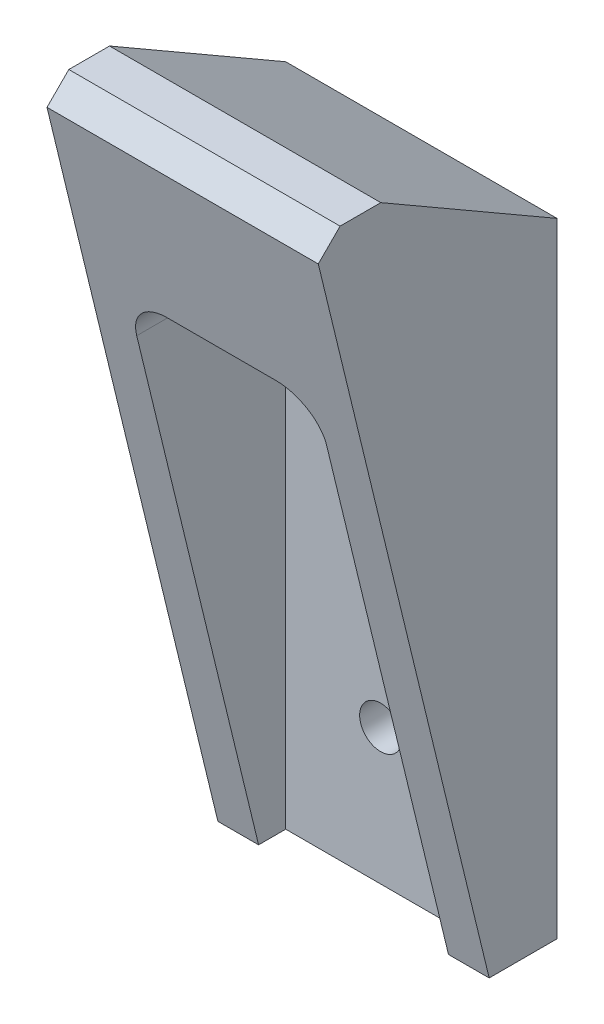
ISO-10303-21;
HEADER;
FILE_DESCRIPTION(('STEP AP214'),'2;1');
FILE_NAME('part.step','',(''),(''),'','','');
FILE_SCHEMA(('AUTOMOTIVE_DESIGN { 1 0 10303 214 1 1 1 1 }'));
ENDSEC;
DATA;
#1=APPLICATION_CONTEXT('core data for automotive mechanical design processes');
#2=APPLICATION_PROTOCOL_DEFINITION('international standard','automotive_design',2000,#1);
#3=PRODUCT_CONTEXT('',#1,'mechanical');
#4=PRODUCT('Part','Part','',(#3));
#5=PRODUCT_RELATED_PRODUCT_CATEGORY('part','',(#4));
#6=PRODUCT_DEFINITION_FORMATION('','',#4);
#7=PRODUCT_DEFINITION_CONTEXT('part definition',#1,'design');
#8=PRODUCT_DEFINITION('design','',#6,#7);
#9=PRODUCT_DEFINITION_SHAPE('','',#8);
#10=(LENGTH_UNIT() NAMED_UNIT(*) SI_UNIT(.MILLI.,.METRE.));
#11=(NAMED_UNIT(*) PLANE_ANGLE_UNIT() SI_UNIT($,.RADIAN.));
#12=(NAMED_UNIT(*) SI_UNIT($,.STERADIAN.) SOLID_ANGLE_UNIT());
#13=UNCERTAINTY_MEASURE_WITH_UNIT(LENGTH_MEASURE(1.E-05),#10,'distance_accuracy_value','');
#14=(GEOMETRIC_REPRESENTATION_CONTEXT(3) GLOBAL_UNCERTAINTY_ASSIGNED_CONTEXT((#13)) GLOBAL_UNIT_ASSIGNED_CONTEXT((#10,
#11,#12)) REPRESENTATION_CONTEXT('',''));
#15=CARTESIAN_POINT('',(0.,0.,0.));
#16=DIRECTION('',(0.,0.,1.));
#17=DIRECTION('',(1.,0.,0.));
#18=AXIS2_PLACEMENT_3D('',#15,#16,#17);
#19=CARTESIAN_POINT('',(20.,53.5,17.9903810567666));
#20=DIRECTION('',(0.,0.235954857589734,-0.971764017228364));
#21=DIRECTION('',(0.,0.971764017228364,0.235954857589734));
#22=AXIS2_PLACEMENT_3D('',#19,#20,#21);
#23=PLANE('',#22);
#24=DIRECTION('',(0.,-0.971764017228364,-0.235954857589734));
#25=VECTOR('',#24,1.);
#26=CARTESIAN_POINT('',(20.,53.5,17.9903810567666));
#27=LINE('',#26,#25);
#28=CARTESIAN_POINT('',(20.,51.8907446716443,17.5996363851223));
#29=VERTEX_POINT('',#28);
#30=CARTESIAN_POINT('',(20.,0.,5.));
#31=VERTEX_POINT('',#30);
#32=EDGE_CURVE('E170',#29,#31,#27,.T.);
#33=ORIENTED_EDGE('',*,*,#32,.F.);
#34=DIRECTION('',(-1.,0.,0.));
#35=VECTOR('',#34,1.);
#36=CARTESIAN_POINT('',(20.,51.8907446716443,17.5996363851223));
#37=LINE('',#36,#35);
#38=CARTESIAN_POINT('',(0.,51.8907446716443,17.5996363851223));
#39=VERTEX_POINT('',#38);
#40=EDGE_CURVE('E214',#29,#39,#37,.T.);
#41=ORIENTED_EDGE('',*,*,#40,.T.);
#42=DIRECTION('',(0.,-0.971764017228364,-0.235954857589734));
#43=VECTOR('',#42,1.);
#44=CARTESIAN_POINT('',(0.,53.5,17.9903810567666));
#45=LINE('',#44,#43);
#46=CARTESIAN_POINT('',(0.,0.,5.));
#47=VERTEX_POINT('',#46);
#48=EDGE_CURVE('E181',#39,#47,#45,.T.);
#49=ORIENTED_EDGE('',*,*,#48,.T.);
#50=DIRECTION('',(-1.,0.,0.));
#51=VECTOR('',#50,1.);
#52=CARTESIAN_POINT('',(20.,0.,5.));
#53=LINE('',#52,#51);
#54=CARTESIAN_POINT('',(3.,0.,5.));
#55=VERTEX_POINT('',#54);
#56=EDGE_CURVE('E186',#55,#47,#53,.T.);
#57=ORIENTED_EDGE('',*,*,#56,.F.);
#58=DIRECTION('',(0.,-0.971764017228364,-0.235954857589734));
#59=VECTOR('',#58,1.);
#60=CARTESIAN_POINT('',(3.,53.5,17.9903810567666));
#61=LINE('',#60,#59);
#62=CARTESIAN_POINT('',(3.,37.,13.9840018523433));
#63=VERTEX_POINT('',#62);
#64=EDGE_CURVE('E159',#63,#55,#61,.T.);
#65=ORIENTED_EDGE('',*,*,#64,.F.);
#66=CARTESIAN_POINT('',(6.,37.,13.9840018523433));
#67=DIRECTION('',(0.,0.235954857589734,-0.971764017228364));
#68=DIRECTION('',(0.,-0.971764017228364,-0.235954857589734));
#69=AXIS2_PLACEMENT_3D('',#66,#67,#68);
#70=ELLIPSE('',#69,3.08716925798149,3.);
#71=CARTESIAN_POINT('',(6.,40.,14.7124344349657));
#72=VERTEX_POINT('',#71);
#73=EDGE_CURVE('E210',#63,#72,#70,.T.);
#74=ORIENTED_EDGE('',*,*,#73,.T.);
#75=DIRECTION('',(-1.,0.,0.));
#76=VECTOR('',#75,1.);
#77=CARTESIAN_POINT('',(20.,40.,14.7124344349657));
#78=LINE('',#77,#76);
#79=CARTESIAN_POINT('',(14.,40.,14.7124344349657));
#80=VERTEX_POINT('',#79);
#81=EDGE_CURVE('E194',#80,#72,#78,.T.);
#82=ORIENTED_EDGE('',*,*,#81,.F.);
#83=CARTESIAN_POINT('',(14.,37.,13.9840018523433));
#84=DIRECTION('',(0.,0.235954857589734,-0.971764017228364));
#85=DIRECTION('',(0.,-0.971764017228364,-0.235954857589734));
#86=AXIS2_PLACEMENT_3D('',#83,#84,#85);
#87=ELLIPSE('',#86,3.08716925798149,3.);
#88=CARTESIAN_POINT('',(17.,37.,13.9840018523433));
#89=VERTEX_POINT('',#88);
#90=EDGE_CURVE('E212',#80,#89,#87,.T.);
#91=ORIENTED_EDGE('',*,*,#90,.T.);
#92=DIRECTION('',(0.,0.971764017228364,0.235954857589734));
#93=VECTOR('',#92,1.);
#94=CARTESIAN_POINT('',(17.,53.5,17.9903810567666));
#95=LINE('',#94,#93);
#96=CARTESIAN_POINT('',(17.,0.,5.));
#97=VERTEX_POINT('',#96);
#98=EDGE_CURVE('E157',#97,#89,#95,.T.);
#99=ORIENTED_EDGE('',*,*,#98,.F.);
#100=EDGE_CURVE('E149',#31,#97,#53,.T.);
#101=ORIENTED_EDGE('',*,*,#100,.F.);
#102=EDGE_LOOP('',(#33,#41,#49,#57,#65,#74,#82,#91,#99,#101));
#103=FACE_BOUND('',#102,.T.);
#104=ADVANCED_FACE('F34',(#103),#23,.F.);
#105=CARTESIAN_POINT('',(20.,0.,0.));
#106=DIRECTION('',(0.,1.,0.));
#107=DIRECTION('',(0.,0.,1.));
#108=AXIS2_PLACEMENT_3D('',#105,#106,#107);
#109=PLANE('',#108);
#110=DIRECTION('',(0.,0.,1.));
#111=VECTOR('',#110,1.);
#112=CARTESIAN_POINT('',(3.,0.,-42.3792402008342));
#113=LINE('',#112,#111);
#114=CARTESIAN_POINT('',(3.,0.,3.));
#115=VERTEX_POINT('',#114);
#116=EDGE_CURVE('E150',#115,#55,#113,.T.);
#117=ORIENTED_EDGE('',*,*,#116,.T.);
#118=ORIENTED_EDGE('',*,*,#56,.T.);
#119=DIRECTION('',(0.,0.,-1.));
#120=VECTOR('',#119,1.);
#121=CARTESIAN_POINT('',(0.,0.,0.));
#122=LINE('',#121,#120);
#123=CARTESIAN_POINT('',(0.,0.,0.));
#124=VERTEX_POINT('',#123);
#125=EDGE_CURVE('E166',#47,#124,#122,.T.);
#126=ORIENTED_EDGE('',*,*,#125,.T.);
#127=DIRECTION('',(-1.,0.,0.));
#128=VECTOR('',#127,1.);
#129=CARTESIAN_POINT('',(20.,0.,0.));
#130=LINE('',#129,#128);
#131=CARTESIAN_POINT('',(20.,0.,0.));
#132=VERTEX_POINT('',#131);
#133=EDGE_CURVE('E174',#132,#124,#130,.T.);
#134=ORIENTED_EDGE('',*,*,#133,.F.);
#135=DIRECTION('',(0.,0.,-1.));
#136=VECTOR('',#135,1.);
#137=CARTESIAN_POINT('',(20.,0.,0.));
#138=LINE('',#137,#136);
#139=EDGE_CURVE('E172',#31,#132,#138,.T.);
#140=ORIENTED_EDGE('',*,*,#139,.F.);
#141=ORIENTED_EDGE('',*,*,#100,.T.);
#142=DIRECTION('',(0.,0.,1.));
#143=VECTOR('',#142,1.);
#144=CARTESIAN_POINT('',(17.,0.,-42.3792402008342));
#145=LINE('',#144,#143);
#146=CARTESIAN_POINT('',(17.,0.,3.));
#147=VERTEX_POINT('',#146);
#148=EDGE_CURVE('E127',#147,#97,#145,.T.);
#149=ORIENTED_EDGE('',*,*,#148,.F.);
#150=DIRECTION('',(-1.,0.,0.));
#151=VECTOR('',#150,1.);
#152=CARTESIAN_POINT('',(0.,0.,3.));
#153=LINE('',#152,#151);
#154=EDGE_CURVE('E134',#147,#115,#153,.T.);
#155=ORIENTED_EDGE('',*,*,#154,.T.);
#156=EDGE_LOOP('',(#117,#118,#126,#134,#140,#141,#149,#155));
#157=FACE_BOUND('',#156,.T.);
#158=ADVANCED_FACE('F146',(#157),#109,.F.);
#159=CARTESIAN_POINT('',(20.,0.,0.));
#160=DIRECTION('',(0.,0.,1.));
#161=DIRECTION('',(1.,0.,0.));
#162=AXIS2_PLACEMENT_3D('',#159,#160,#161);
#163=PLANE('',#162);
#164=CARTESIAN_POINT('',(10.,30.,0.));
#165=DIRECTION('',(0.,0.,1.));
#166=DIRECTION('',(1.,0.,0.));
#167=AXIS2_PLACEMENT_3D('',#164,#165,#166);
#168=CIRCLE('',#167,1.549999948);
#169=CARTESIAN_POINT('',(11.549999948,30.,0.));
#170=VERTEX_POINT('',#169);
#171=EDGE_CURVE('E307',#170,#170,#168,.T.);
#172=ORIENTED_EDGE('',*,*,#171,.T.);
#173=EDGE_LOOP('',(#172));
#174=FACE_BOUND('',#173,.T.);
#175=CARTESIAN_POINT('',(10.,10.,0.));
#176=DIRECTION('',(0.,0.,1.));
#177=DIRECTION('',(1.,0.,0.));
#178=AXIS2_PLACEMENT_3D('',#175,#176,#177);
#179=CIRCLE('',#178,1.549999948);
#180=CARTESIAN_POINT('',(11.549999948,10.,0.));
#181=VERTEX_POINT('',#180);
#182=EDGE_CURVE('E153',#181,#181,#179,.T.);
#183=ORIENTED_EDGE('',*,*,#182,.T.);
#184=EDGE_LOOP('',(#183));
#185=FACE_BOUND('',#184,.T.);
#186=DIRECTION('',(0.,1.,0.));
#187=VECTOR('',#186,1.);
#188=CARTESIAN_POINT('',(0.,0.,0.));
#189=LINE('',#188,#187);
#190=CARTESIAN_POINT('',(0.,46.,0.));
#191=VERTEX_POINT('',#190);
#192=EDGE_CURVE('E161',#124,#191,#189,.T.);
#193=ORIENTED_EDGE('',*,*,#192,.T.);
#194=DIRECTION('',(-1.,0.,0.));
#195=VECTOR('',#194,1.);
#196=CARTESIAN_POINT('',(20.,46.,0.));
#197=LINE('',#196,#195);
#198=CARTESIAN_POINT('',(20.,46.,0.));
#199=VERTEX_POINT('',#198);
#200=EDGE_CURVE('E191',#199,#191,#197,.T.);
#201=ORIENTED_EDGE('',*,*,#200,.F.);
#202=DIRECTION('',(0.,1.,0.));
#203=VECTOR('',#202,1.);
#204=CARTESIAN_POINT('',(20.,0.,0.));
#205=LINE('',#204,#203);
#206=EDGE_CURVE('E162',#132,#199,#205,.T.);
#207=ORIENTED_EDGE('',*,*,#206,.F.);
#208=ORIENTED_EDGE('',*,*,#133,.T.);
#209=EDGE_LOOP('',(#193,#201,#207,#208));
#210=FACE_BOUND('',#209,.T.);
#211=ADVANCED_FACE('F230',(#174,#185,#210),#163,.F.);
#212=CARTESIAN_POINT('',(20.,46.,0.));
#213=DIRECTION('',(0.,-0.86602540378444,0.499999999999997));
#214=DIRECTION('',(0.,-0.499999999999997,-0.86602540378444));
#215=AXIS2_PLACEMENT_3D('',#212,#213,#214);
#216=PLANE('',#215);
#217=DIRECTION('',(0.,0.499999999999997,0.86602540378444));
#218=VECTOR('',#217,1.);
#219=CARTESIAN_POINT('',(0.,46.,0.));
#220=LINE('',#219,#218);
#221=CARTESIAN_POINT('',(0.,53.5,12.9903810567666));
#222=VERTEX_POINT('',#221);
#223=EDGE_CURVE('E177',#191,#222,#220,.T.);
#224=ORIENTED_EDGE('',*,*,#223,.T.);
#225=DIRECTION('',(-1.,0.,0.));
#226=VECTOR('',#225,1.);
#227=CARTESIAN_POINT('',(20.,53.5,12.9903810567666));
#228=LINE('',#227,#226);
#229=CARTESIAN_POINT('',(20.,53.5,12.9903810567666));
#230=VERTEX_POINT('',#229);
#231=EDGE_CURVE('E188',#230,#222,#228,.T.);
#232=ORIENTED_EDGE('',*,*,#231,.F.);
#233=DIRECTION('',(0.,0.499999999999997,0.86602540378444));
#234=VECTOR('',#233,1.);
#235=CARTESIAN_POINT('',(20.,46.,0.));
#236=LINE('',#235,#234);
#237=EDGE_CURVE('E165',#199,#230,#236,.T.);
#238=ORIENTED_EDGE('',*,*,#237,.F.);
#239=ORIENTED_EDGE('',*,*,#200,.T.);
#240=EDGE_LOOP('',(#224,#232,#238,#239));
#241=FACE_BOUND('',#240,.T.);
#242=ADVANCED_FACE('F269',(#241),#216,.F.);
#243=CARTESIAN_POINT('',(20.,53.5,12.9903810567666));
#244=DIRECTION('',(0.,-1.,0.));
#245=DIRECTION('',(0.,0.,-1.));
#246=AXIS2_PLACEMENT_3D('',#243,#244,#245);
#247=PLANE('',#246);
#248=DIRECTION('',(0.,0.,1.));
#249=VECTOR('',#248,1.);
#250=CARTESIAN_POINT('',(0.,53.5,12.9903810567666));
#251=LINE('',#250,#249);
#252=CARTESIAN_POINT('',(0.,53.5,15.9903810567666));
#253=VERTEX_POINT('',#252);
#254=EDGE_CURVE('E179',#222,#253,#251,.T.);
#255=ORIENTED_EDGE('',*,*,#254,.T.);
#256=DIRECTION('',(1.,0.,0.));
#257=VECTOR('',#256,1.);
#258=CARTESIAN_POINT('',(20.,53.5,15.9903810567666));
#259=LINE('',#258,#257);
#260=CARTESIAN_POINT('',(20.,53.5,15.9903810567666));
#261=VERTEX_POINT('',#260);
#262=EDGE_CURVE('E42',#253,#261,#259,.T.);
#263=ORIENTED_EDGE('',*,*,#262,.T.);
#264=DIRECTION('',(0.,0.,1.));
#265=VECTOR('',#264,1.);
#266=CARTESIAN_POINT('',(20.,53.5,12.9903810567666));
#267=LINE('',#266,#265);
#268=EDGE_CURVE('E168',#230,#261,#267,.T.);
#269=ORIENTED_EDGE('',*,*,#268,.F.);
#270=ORIENTED_EDGE('',*,*,#231,.T.);
#271=EDGE_LOOP('',(#255,#263,#269,#270));
#272=FACE_BOUND('',#271,.T.);
#273=ADVANCED_FACE('F266',(#272),#247,.F.);
#274=CARTESIAN_POINT('',(20.,0.,0.));
#275=DIRECTION('',(1.,0.,0.));
#276=DIRECTION('',(0.,0.,-1.));
#277=AXIS2_PLACEMENT_3D('',#274,#275,#276);
#278=PLANE('',#277);
#279=ORIENTED_EDGE('',*,*,#268,.T.);
#280=DIRECTION('',(0.,0.707106781186546,-0.707106781186549));
#281=VECTOR('',#280,1.);
#282=CARTESIAN_POINT('',(20.,34.7451905283834,34.7451905283832));
#283=LINE('',#282,#281);
#284=EDGE_CURVE('E12',#261,#29,#283,.F.);
#285=ORIENTED_EDGE('',*,*,#284,.T.);
#286=ORIENTED_EDGE('',*,*,#32,.T.);
#287=ORIENTED_EDGE('',*,*,#139,.T.);
#288=ORIENTED_EDGE('',*,*,#206,.T.);
#289=ORIENTED_EDGE('',*,*,#237,.T.);
#290=EDGE_LOOP('',(#279,#285,#286,#287,#288,#289));
#291=FACE_BOUND('',#290,.T.);
#292=ADVANCED_FACE('F233',(#291),#278,.T.);
#293=CARTESIAN_POINT('',(0.,0.,0.));
#294=DIRECTION('',(1.,0.,0.));
#295=DIRECTION('',(0.,0.,-1.));
#296=AXIS2_PLACEMENT_3D('',#293,#294,#295);
#297=PLANE('',#296);
#298=ORIENTED_EDGE('',*,*,#48,.F.);
#299=DIRECTION('',(0.,-0.707106781186546,0.707106781186549));
#300=VECTOR('',#299,1.);
#301=CARTESIAN_POINT('',(0.,51.8907446716443,17.5996363851223));
#302=LINE('',#301,#300);
#303=EDGE_CURVE('E56',#39,#253,#302,.F.);
#304=ORIENTED_EDGE('',*,*,#303,.T.);
#305=ORIENTED_EDGE('',*,*,#254,.F.);
#306=ORIENTED_EDGE('',*,*,#223,.F.);
#307=ORIENTED_EDGE('',*,*,#192,.F.);
#308=ORIENTED_EDGE('',*,*,#125,.F.);
#309=EDGE_LOOP('',(#298,#304,#305,#306,#307,#308));
#310=FACE_BOUND('',#309,.T.);
#311=ADVANCED_FACE('F225',(#310),#297,.F.);
#312=CARTESIAN_POINT('',(0.,40.,-42.3792402008342));
#313=DIRECTION('',(0.,-1.,0.));
#314=DIRECTION('',(0.,0.,-1.));
#315=AXIS2_PLACEMENT_3D('',#312,#313,#314);
#316=PLANE('',#315);
#317=ORIENTED_EDGE('',*,*,#81,.T.);
#318=DIRECTION('',(0.,0.,1.));
#319=VECTOR('',#318,1.);
#320=CARTESIAN_POINT('',(6.,40.,3.));
#321=LINE('',#320,#319);
#322=CARTESIAN_POINT('',(6.,40.,3.));
#323=VERTEX_POINT('',#322);
#324=EDGE_CURVE('E203',#72,#323,#321,.F.);
#325=ORIENTED_EDGE('',*,*,#324,.T.);
#326=DIRECTION('',(-1.,0.,0.));
#327=VECTOR('',#326,1.);
#328=CARTESIAN_POINT('',(0.,40.,3.));
#329=LINE('',#328,#327);
#330=CARTESIAN_POINT('',(14.,40.,3.));
#331=VERTEX_POINT('',#330);
#332=EDGE_CURVE('E133',#331,#323,#329,.T.);
#333=ORIENTED_EDGE('',*,*,#332,.F.);
#334=DIRECTION('',(0.,0.,1.));
#335=VECTOR('',#334,1.);
#336=CARTESIAN_POINT('',(14.,40.,14.7124344349657));
#337=LINE('',#336,#335);
#338=EDGE_CURVE('E200',#331,#80,#337,.T.);
#339=ORIENTED_EDGE('',*,*,#338,.T.);
#340=EDGE_LOOP('',(#317,#325,#333,#339));
#341=FACE_BOUND('',#340,.T.);
#342=ADVANCED_FACE('F242',(#341),#316,.T.);
#343=CARTESIAN_POINT('',(3.,0.,-42.3792402008342));
#344=DIRECTION('',(1.,0.,0.));
#345=DIRECTION('',(0.,0.,-1.));
#346=AXIS2_PLACEMENT_3D('',#343,#344,#345);
#347=PLANE('',#346);
#348=DIRECTION('',(0.,-1.,0.));
#349=VECTOR('',#348,1.);
#350=CARTESIAN_POINT('',(3.,0.,3.));
#351=LINE('',#350,#349);
#352=CARTESIAN_POINT('',(3.,37.,3.));
#353=VERTEX_POINT('',#352);
#354=EDGE_CURVE('E140',#353,#115,#351,.T.);
#355=ORIENTED_EDGE('',*,*,#354,.F.);
#356=DIRECTION('',(0.,0.,1.));
#357=VECTOR('',#356,1.);
#358=CARTESIAN_POINT('',(3.,37.,14.7124344349657));
#359=LINE('',#358,#357);
#360=EDGE_CURVE('E197',#353,#63,#359,.T.);
#361=ORIENTED_EDGE('',*,*,#360,.T.);
#362=ORIENTED_EDGE('',*,*,#64,.T.);
#363=ORIENTED_EDGE('',*,*,#116,.F.);
#364=EDGE_LOOP('',(#355,#361,#362,#363));
#365=FACE_BOUND('',#364,.T.);
#366=ADVANCED_FACE('F248',(#365),#347,.T.);
#367=CARTESIAN_POINT('',(17.,0.,-42.3792402008342));
#368=DIRECTION('',(-1.,0.,0.));
#369=DIRECTION('',(0.,0.,1.));
#370=AXIS2_PLACEMENT_3D('',#367,#368,#369);
#371=PLANE('',#370);
#372=ORIENTED_EDGE('',*,*,#98,.T.);
#373=DIRECTION('',(0.,0.,1.));
#374=VECTOR('',#373,1.);
#375=CARTESIAN_POINT('',(17.,37.,3.));
#376=LINE('',#375,#374);
#377=CARTESIAN_POINT('',(17.,37.,3.));
#378=VERTEX_POINT('',#377);
#379=EDGE_CURVE('E130',#89,#378,#376,.F.);
#380=ORIENTED_EDGE('',*,*,#379,.T.);
#381=DIRECTION('',(0.,1.,0.));
#382=VECTOR('',#381,1.);
#383=CARTESIAN_POINT('',(17.,0.,3.));
#384=LINE('',#383,#382);
#385=EDGE_CURVE('E122',#147,#378,#384,.T.);
#386=ORIENTED_EDGE('',*,*,#385,.F.);
#387=ORIENTED_EDGE('',*,*,#148,.T.);
#388=EDGE_LOOP('',(#372,#380,#386,#387));
#389=FACE_BOUND('',#388,.T.);
#390=ADVANCED_FACE('F125',(#389),#371,.T.);
#391=CARTESIAN_POINT('',(20.,0.,3.));
#392=DIRECTION('',(0.,0.,1.));
#393=DIRECTION('',(1.,0.,0.));
#394=AXIS2_PLACEMENT_3D('',#391,#392,#393);
#395=PLANE('',#394);
#396=CARTESIAN_POINT('',(10.,30.,3.));
#397=DIRECTION('',(0.,0.,1.));
#398=DIRECTION('',(1.,0.,0.));
#399=AXIS2_PLACEMENT_3D('',#396,#397,#398);
#400=CIRCLE('',#399,1.54999994799999);
#401=CARTESIAN_POINT('',(11.549999948,30.,3.));
#402=VERTEX_POINT('',#401);
#403=EDGE_CURVE('E303',#402,#402,#400,.T.);
#404=ORIENTED_EDGE('',*,*,#403,.F.);
#405=EDGE_LOOP('',(#404));
#406=FACE_BOUND('',#405,.T.);
#407=CARTESIAN_POINT('',(10.,10.,3.));
#408=DIRECTION('',(0.,0.,1.));
#409=DIRECTION('',(1.,0.,0.));
#410=AXIS2_PLACEMENT_3D('',#407,#408,#409);
#411=CIRCLE('',#410,1.54999994799999);
#412=CARTESIAN_POINT('',(11.549999948,10.,3.));
#413=VERTEX_POINT('',#412);
#414=EDGE_CURVE('E306',#413,#413,#411,.T.);
#415=ORIENTED_EDGE('',*,*,#414,.F.);
#416=EDGE_LOOP('',(#415));
#417=FACE_BOUND('',#416,.T.);
#418=ORIENTED_EDGE('',*,*,#332,.T.);
#419=CARTESIAN_POINT('',(6.,37.,3.));
#420=DIRECTION('',(0.,0.,1.));
#421=DIRECTION('',(1.,0.,0.));
#422=AXIS2_PLACEMENT_3D('',#419,#420,#421);
#423=CIRCLE('',#422,3.);
#424=EDGE_CURVE('E207',#323,#353,#423,.T.);
#425=ORIENTED_EDGE('',*,*,#424,.T.);
#426=ORIENTED_EDGE('',*,*,#354,.T.);
#427=ORIENTED_EDGE('',*,*,#154,.F.);
#428=ORIENTED_EDGE('',*,*,#385,.T.);
#429=CARTESIAN_POINT('',(14.,37.,3.));
#430=DIRECTION('',(0.,0.,1.));
#431=DIRECTION('',(1.,0.,0.));
#432=AXIS2_PLACEMENT_3D('',#429,#430,#431);
#433=CIRCLE('',#432,3.);
#434=EDGE_CURVE('E205',#378,#331,#433,.T.);
#435=ORIENTED_EDGE('',*,*,#434,.T.);
#436=EDGE_LOOP('',(#418,#425,#426,#427,#428,#435));
#437=FACE_BOUND('',#436,.T.);
#438=ADVANCED_FACE('F138',(#406,#417,#437),#395,.T.);
#439=CARTESIAN_POINT('',(6.,37.,-42.3792402008342));
#440=DIRECTION('',(0.,0.,-1.));
#441=DIRECTION('',(-1.,0.,0.));
#442=AXIS2_PLACEMENT_3D('',#439,#440,#441);
#443=CYLINDRICAL_SURFACE('',#442,3.);
#444=ORIENTED_EDGE('',*,*,#424,.F.);
#445=ORIENTED_EDGE('',*,*,#324,.F.);
#446=ORIENTED_EDGE('',*,*,#73,.F.);
#447=ORIENTED_EDGE('',*,*,#360,.F.);
#448=EDGE_LOOP('',(#444,#445,#446,#447));
#449=FACE_BOUND('',#448,.T.);
#450=ADVANCED_FACE('F245',(#449),#443,.F.);
#451=CARTESIAN_POINT('',(14.,37.,-42.3792402008342));
#452=DIRECTION('',(0.,0.,-1.));
#453=DIRECTION('',(-1.,0.,0.));
#454=AXIS2_PLACEMENT_3D('',#451,#452,#453);
#455=CYLINDRICAL_SURFACE('',#454,3.);
#456=ORIENTED_EDGE('',*,*,#434,.F.);
#457=ORIENTED_EDGE('',*,*,#379,.F.);
#458=ORIENTED_EDGE('',*,*,#90,.F.);
#459=ORIENTED_EDGE('',*,*,#338,.F.);
#460=EDGE_LOOP('',(#456,#457,#458,#459));
#461=FACE_BOUND('',#460,.T.);
#462=ADVANCED_FACE('F237',(#461),#455,.F.);
#463=CARTESIAN_POINT('',(20.,51.8907446716443,17.5996363851223));
#464=DIRECTION('',(0.,-0.707106781186549,-0.707106781186546));
#465=DIRECTION('',(-1.,0.,0.));
#466=AXIS2_PLACEMENT_3D('',#463,#464,#465);
#467=PLANE('',#466);
#468=ORIENTED_EDGE('',*,*,#284,.F.);
#469=ORIENTED_EDGE('',*,*,#262,.F.);
#470=ORIENTED_EDGE('',*,*,#303,.F.);
#471=ORIENTED_EDGE('',*,*,#40,.F.);
#472=EDGE_LOOP('',(#468,#469,#470,#471));
#473=FACE_BOUND('',#472,.T.);
#474=ADVANCED_FACE('F36',(#473),#467,.F.);
#475=CARTESIAN_POINT('',(10.,10.,3.));
#476=DIRECTION('',(0.,0.,1.));
#477=DIRECTION('',(1.,0.,0.));
#478=AXIS2_PLACEMENT_3D('',#475,#476,#477);
#479=CYLINDRICAL_SURFACE('',#478,1.54999994799999);
#480=ORIENTED_EDGE('',*,*,#182,.F.);
#481=EDGE_LOOP('',(#480));
#482=FACE_BOUND('',#481,.T.);
#483=ORIENTED_EDGE('',*,*,#414,.T.);
#484=EDGE_LOOP('',(#483));
#485=FACE_BOUND('',#484,.T.);
#486=ADVANCED_FACE('F281',(#482,#485),#479,.F.);
#487=CARTESIAN_POINT('',(10.,30.,3.));
#488=DIRECTION('',(0.,0.,1.));
#489=DIRECTION('',(1.,0.,0.));
#490=AXIS2_PLACEMENT_3D('',#487,#488,#489);
#491=CYLINDRICAL_SURFACE('',#490,1.54999994799999);
#492=ORIENTED_EDGE('',*,*,#171,.F.);
#493=EDGE_LOOP('',(#492));
#494=FACE_BOUND('',#493,.T.);
#495=ORIENTED_EDGE('',*,*,#403,.T.);
#496=EDGE_LOOP('',(#495));
#497=FACE_BOUND('',#496,.T.);
#498=ADVANCED_FACE('F285',(#494,#497),#491,.F.);
#499=CLOSED_SHELL('',(#104,#158,#211,#242,#273,#292,#311,#342,#366,#390,#438,#450,#462,#474,
#486,#498));
#500=MANIFOLD_SOLID_BREP('B2',#499);
#501=ADVANCED_BREP_SHAPE_REPRESENTATION('',(#18,#500),#14);
#502=SHAPE_DEFINITION_REPRESENTATION(#9,#501);
ENDSEC;
END-ISO-10303-21;
